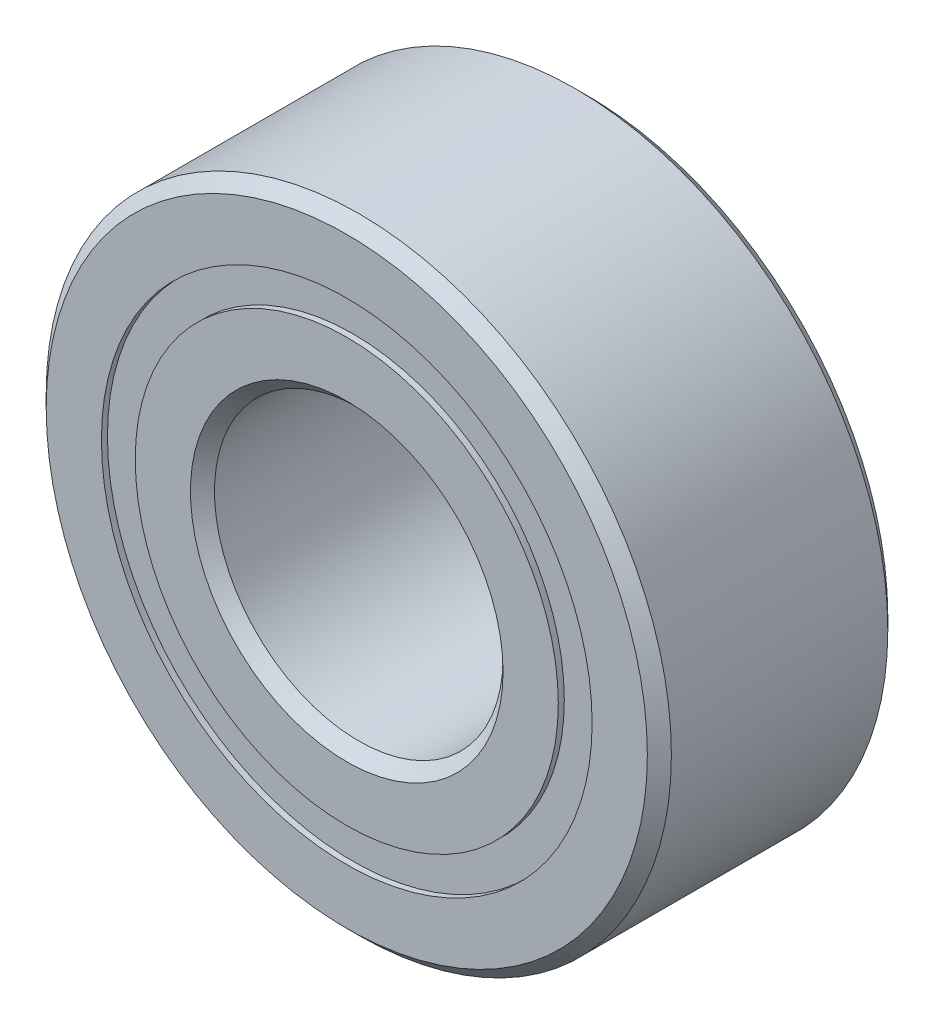
ISO-10303-21;
HEADER;
FILE_DESCRIPTION(('STEP AP214'),'2;1');
FILE_NAME('part.step','',(''),(''),'','','');
FILE_SCHEMA(('AUTOMOTIVE_DESIGN { 1 0 10303 214 1 1 1 1 }'));
ENDSEC;
DATA;
#1=APPLICATION_CONTEXT('core data for automotive mechanical design processes');
#2=APPLICATION_PROTOCOL_DEFINITION('international standard','automotive_design',2000,#1);
#3=PRODUCT_CONTEXT('',#1,'mechanical');
#4=PRODUCT('Part','Part','',(#3));
#5=PRODUCT_RELATED_PRODUCT_CATEGORY('part','',(#4));
#6=PRODUCT_DEFINITION_FORMATION('','',#4);
#7=PRODUCT_DEFINITION_CONTEXT('part definition',#1,'design');
#8=PRODUCT_DEFINITION('design','',#6,#7);
#9=PRODUCT_DEFINITION_SHAPE('','',#8);
#10=(LENGTH_UNIT() NAMED_UNIT(*) SI_UNIT(.MILLI.,.METRE.));
#11=(NAMED_UNIT(*) PLANE_ANGLE_UNIT() SI_UNIT($,.RADIAN.));
#12=(NAMED_UNIT(*) SI_UNIT($,.STERADIAN.) SOLID_ANGLE_UNIT());
#13=UNCERTAINTY_MEASURE_WITH_UNIT(LENGTH_MEASURE(1.E-05),#10,'distance_accuracy_value','');
#14=(GEOMETRIC_REPRESENTATION_CONTEXT(3) GLOBAL_UNCERTAINTY_ASSIGNED_CONTEXT((#13)) GLOBAL_UNIT_ASSIGNED_CONTEXT((#10,
#11,#12)) REPRESENTATION_CONTEXT('',''));
#15=CARTESIAN_POINT('',(0.,0.,0.));
#16=DIRECTION('',(0.,0.,1.));
#17=DIRECTION('',(1.,0.,0.));
#18=AXIS2_PLACEMENT_3D('',#15,#16,#17);
#19=CARTESIAN_POINT('',(0.,5.10164835164835,-2.375));
#20=DIRECTION('',(0.,0.,1.));
#21=DIRECTION('',(1.,0.,0.));
#22=AXIS2_PLACEMENT_3D('',#19,#20,#21);
#23=PLANE('',#22);
#24=CARTESIAN_POINT('',(0.,0.,-2.375));
#25=DIRECTION('',(0.,0.,1.));
#26=DIRECTION('',(1.,0.,0.));
#27=AXIS2_PLACEMENT_3D('',#24,#25,#26);
#28=CIRCLE('',#27,5.10164835164835);
#29=CARTESIAN_POINT('',(5.10164835164835,0.,-2.375));
#30=VERTEX_POINT('',#29);
#31=EDGE_CURVE('E64',#30,#30,#28,.T.);
#32=ORIENTED_EDGE('',*,*,#31,.F.);
#33=EDGE_LOOP('',(#32));
#34=FACE_BOUND('',#33,.T.);
#35=CARTESIAN_POINT('',(0.,0.,-2.375));
#36=DIRECTION('',(0.,0.,1.));
#37=DIRECTION('',(1.,0.,0.));
#38=AXIS2_PLACEMENT_3D('',#35,#36,#37);
#39=CIRCLE('',#38,4.39835164835165);
#40=CARTESIAN_POINT('',(4.39835164835165,0.,-2.375));
#41=VERTEX_POINT('',#40);
#42=EDGE_CURVE('E11',#41,#41,#39,.T.);
#43=ORIENTED_EDGE('',*,*,#42,.T.);
#44=EDGE_LOOP('',(#43));
#45=FACE_BOUND('',#44,.T.);
#46=ADVANCED_FACE('F50',(#34,#45),#23,.F.);
#47=CARTESIAN_POINT('',(0.,0.,2.5));
#48=DIRECTION('',(0.,0.,1.));
#49=DIRECTION('',(1.,0.,0.));
#50=AXIS2_PLACEMENT_3D('',#47,#48,#49);
#51=CYLINDRICAL_SURFACE('',#50,4.39835164835165);
#52=ORIENTED_EDGE('',*,*,#42,.F.);
#53=EDGE_LOOP('',(#52));
#54=FACE_BOUND('',#53,.T.);
#55=CARTESIAN_POINT('',(0.,0.,-1.16542887575844));
#56=DIRECTION('',(0.,0.,1.));
#57=DIRECTION('',(1.,0.,0.));
#58=AXIS2_PLACEMENT_3D('',#55,#56,#57);
#59=CIRCLE('',#58,4.39835164835165);
#60=CARTESIAN_POINT('',(4.39835164835165,0.,-1.16542887575844));
#61=VERTEX_POINT('',#60);
#62=EDGE_CURVE('E56',#61,#61,#59,.T.);
#63=ORIENTED_EDGE('',*,*,#62,.T.);
#64=EDGE_LOOP('',(#63));
#65=FACE_BOUND('',#64,.T.);
#66=ADVANCED_FACE('F73',(#54,#65),#51,.F.);
#67=CARTESIAN_POINT('',(0.,5.10164835164835,-1.16542887575844));
#68=DIRECTION('',(0.,0.,-1.));
#69=DIRECTION('',(-1.,0.,0.));
#70=AXIS2_PLACEMENT_3D('',#67,#68,#69);
#71=PLANE('',#70);
#72=ORIENTED_EDGE('',*,*,#62,.F.);
#73=EDGE_LOOP('',(#72));
#74=FACE_BOUND('',#73,.T.);
#75=CARTESIAN_POINT('',(0.,0.,-1.16542887575844));
#76=DIRECTION('',(0.,0.,1.));
#77=DIRECTION('',(1.,0.,0.));
#78=AXIS2_PLACEMENT_3D('',#75,#76,#77);
#79=CIRCLE('',#78,5.10164835164835);
#80=CARTESIAN_POINT('',(5.10164835164835,0.,-1.16542887575844));
#81=VERTEX_POINT('',#80);
#82=EDGE_CURVE('E60',#81,#81,#79,.T.);
#83=ORIENTED_EDGE('',*,*,#82,.T.);
#84=EDGE_LOOP('',(#83));
#85=FACE_BOUND('',#84,.T.);
#86=ADVANCED_FACE('F77',(#74,#85),#71,.F.);
#87=CARTESIAN_POINT('',(0.,0.,2.5));
#88=DIRECTION('',(0.,0.,1.));
#89=DIRECTION('',(1.,0.,0.));
#90=AXIS2_PLACEMENT_3D('',#87,#88,#89);
#91=CYLINDRICAL_SURFACE('',#90,5.10164835164835);
#92=ORIENTED_EDGE('',*,*,#82,.F.);
#93=EDGE_LOOP('',(#92));
#94=FACE_BOUND('',#93,.T.);
#95=ORIENTED_EDGE('',*,*,#31,.T.);
#96=EDGE_LOOP('',(#95));
#97=FACE_BOUND('',#96,.T.);
#98=ADVANCED_FACE('F70',(#94,#97),#91,.T.);
#99=CLOSED_SHELL('',(#46,#66,#86,#98));
#100=MANIFOLD_SOLID_BREP('B2',#99);
#101=CARTESIAN_POINT('',(0.,5.10164835164835,2.375));
#102=DIRECTION('',(0.,0.,-1.));
#103=DIRECTION('',(-1.,0.,0.));
#104=AXIS2_PLACEMENT_3D('',#101,#102,#103);
#105=PLANE('',#104);
#106=CARTESIAN_POINT('',(0.,0.,2.375));
#107=DIRECTION('',(0.,0.,1.));
#108=DIRECTION('',(1.,0.,0.));
#109=AXIS2_PLACEMENT_3D('',#106,#107,#108);
#110=CIRCLE('',#109,4.39835164835165);
#111=CARTESIAN_POINT('',(4.39835164835165,0.,2.375));
#112=VERTEX_POINT('',#111);
#113=EDGE_CURVE('E49',#112,#112,#110,.T.);
#114=ORIENTED_EDGE('',*,*,#113,.F.);
#115=EDGE_LOOP('',(#114));
#116=FACE_BOUND('',#115,.T.);
#117=CARTESIAN_POINT('',(0.,0.,2.375));
#118=DIRECTION('',(0.,0.,1.));
#119=DIRECTION('',(1.,0.,0.));
#120=AXIS2_PLACEMENT_3D('',#117,#118,#119);
#121=CIRCLE('',#120,5.10164835164835);
#122=CARTESIAN_POINT('',(5.10164835164835,0.,2.375));
#123=VERTEX_POINT('',#122);
#124=EDGE_CURVE('E124',#123,#123,#121,.T.);
#125=ORIENTED_EDGE('',*,*,#124,.T.);
#126=EDGE_LOOP('',(#125));
#127=FACE_BOUND('',#126,.T.);
#128=ADVANCED_FACE('F110',(#116,#127),#105,.F.);
#129=CARTESIAN_POINT('',(0.,0.,2.5));
#130=DIRECTION('',(0.,0.,1.));
#131=DIRECTION('',(1.,0.,0.));
#132=AXIS2_PLACEMENT_3D('',#129,#130,#131);
#133=CYLINDRICAL_SURFACE('',#132,4.39835164835165);
#134=CARTESIAN_POINT('',(0.,0.,1.16542887575844));
#135=DIRECTION('',(0.,0.,1.));
#136=DIRECTION('',(1.,0.,0.));
#137=AXIS2_PLACEMENT_3D('',#134,#135,#136);
#138=CIRCLE('',#137,4.39835164835165);
#139=CARTESIAN_POINT('',(4.39835164835165,0.,1.16542887575844));
#140=VERTEX_POINT('',#139);
#141=EDGE_CURVE('E116',#140,#140,#138,.T.);
#142=ORIENTED_EDGE('',*,*,#141,.F.);
#143=EDGE_LOOP('',(#142));
#144=FACE_BOUND('',#143,.T.);
#145=ORIENTED_EDGE('',*,*,#113,.T.);
#146=EDGE_LOOP('',(#145));
#147=FACE_BOUND('',#146,.T.);
#148=ADVANCED_FACE('F139',(#144,#147),#133,.F.);
#149=CARTESIAN_POINT('',(0.,5.10164835164835,1.16542887575844));
#150=DIRECTION('',(0.,0.,1.));
#151=DIRECTION('',(1.,0.,0.));
#152=AXIS2_PLACEMENT_3D('',#149,#150,#151);
#153=PLANE('',#152);
#154=CARTESIAN_POINT('',(0.,0.,1.16542887575844));
#155=DIRECTION('',(0.,0.,1.));
#156=DIRECTION('',(1.,0.,0.));
#157=AXIS2_PLACEMENT_3D('',#154,#155,#156);
#158=CIRCLE('',#157,5.10164835164835);
#159=CARTESIAN_POINT('',(5.10164835164835,0.,1.16542887575844));
#160=VERTEX_POINT('',#159);
#161=EDGE_CURVE('E120',#160,#160,#158,.T.);
#162=ORIENTED_EDGE('',*,*,#161,.F.);
#163=EDGE_LOOP('',(#162));
#164=FACE_BOUND('',#163,.T.);
#165=ORIENTED_EDGE('',*,*,#141,.T.);
#166=EDGE_LOOP('',(#165));
#167=FACE_BOUND('',#166,.T.);
#168=ADVANCED_FACE('F134',(#164,#167),#153,.F.);
#169=CARTESIAN_POINT('',(0.,0.,2.5));
#170=DIRECTION('',(0.,0.,1.));
#171=DIRECTION('',(1.,0.,0.));
#172=AXIS2_PLACEMENT_3D('',#169,#170,#171);
#173=CYLINDRICAL_SURFACE('',#172,5.10164835164835);
#174=ORIENTED_EDGE('',*,*,#124,.F.);
#175=EDGE_LOOP('',(#174));
#176=FACE_BOUND('',#175,.T.);
#177=ORIENTED_EDGE('',*,*,#161,.T.);
#178=EDGE_LOOP('',(#177));
#179=FACE_BOUND('',#178,.T.);
#180=ADVANCED_FACE('F131',(#176,#179),#173,.T.);
#181=CLOSED_SHELL('',(#128,#148,#168,#180));
#182=MANIFOLD_SOLID_BREP('B6',#181);
#183=CARTESIAN_POINT('',(-2.37499999999995,4.11362066797611,0.));
#184=DIRECTION('',(0.,0.,1.));
#185=DIRECTION('',(-0.499999999999989,0.866025403784445,0.));
#186=AXIS2_PLACEMENT_3D('',#183,#184,#185);
#187=SPHERICAL_SURFACE('',#186,1.16542887575844);
#188=CARTESIAN_POINT('',(-2.37499999999995,4.11362066797611,1.16542887575844));
#189=VERTEX_POINT('',#188);
#190=VERTEX_LOOP('',#189);
#191=FACE_BOUND('',#190,.T.);
#192=ADVANCED_FACE('F170',(#191),#187,.T.);
#193=CLOSED_SHELL('',(#192));
#194=MANIFOLD_SOLID_BREP('B44',#193);
#195=CARTESIAN_POINT('',(-4.11362066797606,2.37500000000005,0.));
#196=DIRECTION('',(0.,0.,1.));
#197=DIRECTION('',(-0.866025403784433,0.50000000000001,0.));
#198=AXIS2_PLACEMENT_3D('',#195,#196,#197);
#199=SPHERICAL_SURFACE('',#198,1.16542887575844);
#200=CARTESIAN_POINT('',(-4.11362066797606,2.37500000000005,1.16542887575844));
#201=VERTEX_POINT('',#200);
#202=VERTEX_LOOP('',#201);
#203=FACE_BOUND('',#202,.T.);
#204=ADVANCED_FACE('F193',(#203),#199,.T.);
#205=CLOSED_SHELL('',(#204));
#206=MANIFOLD_SOLID_BREP('B106',#205);
#207=CARTESIAN_POINT('',(-4.75,0.,0.));
#208=DIRECTION('',(0.,0.,1.));
#209=DIRECTION('',(-1.,0.,0.));
#210=AXIS2_PLACEMENT_3D('',#207,#208,#209);
#211=SPHERICAL_SURFACE('',#210,1.16542887575844);
#212=CARTESIAN_POINT('',(-4.75,0.,1.16542887575844));
#213=VERTEX_POINT('',#212);
#214=VERTEX_LOOP('',#213);
#215=FACE_BOUND('',#214,.T.);
#216=ADVANCED_FACE('F216',(#215),#211,.T.);
#217=CLOSED_SHELL('',(#216));
#218=MANIFOLD_SOLID_BREP('B166',#217);
#219=CARTESIAN_POINT('',(-4.1136206679761,-2.37499999999996,0.));
#220=DIRECTION('',(0.,0.,1.));
#221=DIRECTION('',(-0.866025403784443,-0.499999999999992,0.));
#222=AXIS2_PLACEMENT_3D('',#219,#220,#221);
#223=SPHERICAL_SURFACE('',#222,1.16542887575844);
#224=CARTESIAN_POINT('',(-4.1136206679761,-2.37499999999996,1.16542887575844));
#225=VERTEX_POINT('',#224);
#226=VERTEX_LOOP('',#225);
#227=FACE_BOUND('',#226,.T.);
#228=ADVANCED_FACE('F239',(#227),#223,.T.);
#229=CLOSED_SHELL('',(#228));
#230=MANIFOLD_SOLID_BREP('B189',#229);
#231=CARTESIAN_POINT('',(-2.37500000000003,-4.11362066797606,0.));
#232=DIRECTION('',(0.,0.,1.));
#233=DIRECTION('',(-0.500000000000007,-0.866025403784435,0.));
#234=AXIS2_PLACEMENT_3D('',#231,#232,#233);
#235=SPHERICAL_SURFACE('',#234,1.16542887575844);
#236=CARTESIAN_POINT('',(-2.37500000000003,-4.11362066797606,1.16542887575844));
#237=VERTEX_POINT('',#236);
#238=VERTEX_LOOP('',#237);
#239=FACE_BOUND('',#238,.T.);
#240=ADVANCED_FACE('F262',(#239),#235,.T.);
#241=CLOSED_SHELL('',(#240));
#242=MANIFOLD_SOLID_BREP('B212',#241);
#243=CARTESIAN_POINT('',(0.,-4.75,0.));
#244=DIRECTION('',(0.,0.,1.));
#245=DIRECTION('',(0.,-1.,0.));
#246=AXIS2_PLACEMENT_3D('',#243,#244,#245);
#247=SPHERICAL_SURFACE('',#246,1.16542887575844);
#248=CARTESIAN_POINT('',(0.,-4.75,1.16542887575844));
#249=VERTEX_POINT('',#248);
#250=VERTEX_LOOP('',#249);
#251=FACE_BOUND('',#250,.T.);
#252=ADVANCED_FACE('F285',(#251),#247,.T.);
#253=CLOSED_SHELL('',(#252));
#254=MANIFOLD_SOLID_BREP('B235',#253);
#255=CARTESIAN_POINT('',(2.37499999999998,-4.1136206679761,0.));
#256=DIRECTION('',(0.,0.,1.));
#257=DIRECTION('',(0.499999999999995,-0.866025403784442,0.));
#258=AXIS2_PLACEMENT_3D('',#255,#256,#257);
#259=SPHERICAL_SURFACE('',#258,1.16542887575844);
#260=CARTESIAN_POINT('',(2.37499999999998,-4.1136206679761,1.16542887575844));
#261=VERTEX_POINT('',#260);
#262=VERTEX_LOOP('',#261);
#263=FACE_BOUND('',#262,.T.);
#264=ADVANCED_FACE('F308',(#263),#259,.T.);
#265=CLOSED_SHELL('',(#264));
#266=MANIFOLD_SOLID_BREP('B258',#265);
#267=CARTESIAN_POINT('',(4.11362066797607,-2.37500000000002,0.));
#268=DIRECTION('',(0.,0.,1.));
#269=DIRECTION('',(0.866025403784436,-0.500000000000004,0.));
#270=AXIS2_PLACEMENT_3D('',#267,#268,#269);
#271=SPHERICAL_SURFACE('',#270,1.16542887575844);
#272=CARTESIAN_POINT('',(4.11362066797607,-2.37500000000002,1.16542887575844));
#273=VERTEX_POINT('',#272);
#274=VERTEX_LOOP('',#273);
#275=FACE_BOUND('',#274,.T.);
#276=ADVANCED_FACE('F331',(#275),#271,.T.);
#277=CLOSED_SHELL('',(#276));
#278=MANIFOLD_SOLID_BREP('B281',#277);
#279=CARTESIAN_POINT('',(4.75,0.,0.));
#280=DIRECTION('',(0.,0.,1.));
#281=DIRECTION('',(1.,0.,0.));
#282=AXIS2_PLACEMENT_3D('',#279,#280,#281);
#283=SPHERICAL_SURFACE('',#282,1.16542887575844);
#284=CARTESIAN_POINT('',(4.75,0.,1.16542887575844));
#285=VERTEX_POINT('',#284);
#286=VERTEX_LOOP('',#285);
#287=FACE_BOUND('',#286,.T.);
#288=ADVANCED_FACE('F354',(#287),#283,.T.);
#289=CLOSED_SHELL('',(#288));
#290=MANIFOLD_SOLID_BREP('B304',#289);
#291=CARTESIAN_POINT('',(4.11362066797609,2.37499999999999,0.));
#292=DIRECTION('',(0.,0.,1.));
#293=DIRECTION('',(0.86602540378444,0.499999999999998,0.));
#294=AXIS2_PLACEMENT_3D('',#291,#292,#293);
#295=SPHERICAL_SURFACE('',#294,1.16542887575844);
#296=CARTESIAN_POINT('',(4.11362066797609,2.37499999999999,1.16542887575844));
#297=VERTEX_POINT('',#296);
#298=VERTEX_LOOP('',#297);
#299=FACE_BOUND('',#298,.T.);
#300=ADVANCED_FACE('F377',(#299),#295,.T.);
#301=CLOSED_SHELL('',(#300));
#302=MANIFOLD_SOLID_BREP('B327',#301);
#303=CARTESIAN_POINT('',(2.375,4.11362066797608,0.));
#304=DIRECTION('',(0.,0.,1.));
#305=DIRECTION('',(0.500000000000001,0.866025403784438,0.));
#306=AXIS2_PLACEMENT_3D('',#303,#304,#305);
#307=SPHERICAL_SURFACE('',#306,1.16542887575844);
#308=CARTESIAN_POINT('',(2.375,4.11362066797608,1.16542887575844));
#309=VERTEX_POINT('',#308);
#310=VERTEX_LOOP('',#309);
#311=FACE_BOUND('',#310,.T.);
#312=ADVANCED_FACE('F400',(#311),#307,.T.);
#313=CLOSED_SHELL('',(#312));
#314=MANIFOLD_SOLID_BREP('B350',#313);
#315=CARTESIAN_POINT('',(0.,4.75,0.));
#316=DIRECTION('',(0.,0.,1.));
#317=DIRECTION('',(0.,1.,0.));
#318=AXIS2_PLACEMENT_3D('',#315,#316,#317);
#319=SPHERICAL_SURFACE('',#318,1.16542887575844);
#320=CARTESIAN_POINT('',(0.,4.75,1.16542887575844));
#321=VERTEX_POINT('',#320);
#322=VERTEX_LOOP('',#321);
#323=FACE_BOUND('',#322,.T.);
#324=ADVANCED_FACE('F425',(#323),#319,.T.);
#325=CLOSED_SHELL('',(#324));
#326=MANIFOLD_SOLID_BREP('B373',#325);
#327=CARTESIAN_POINT('',(0.,4.39835164835165,2.5));
#328=DIRECTION('',(0.,0.,-1.));
#329=DIRECTION('',(-1.,0.,0.));
#330=AXIS2_PLACEMENT_3D('',#327,#328,#329);
#331=PLANE('',#330);
#332=CARTESIAN_POINT('',(0.,0.,2.5));
#333=DIRECTION('',(0.,0.,1.));
#334=DIRECTION('',(1.,0.,0.));
#335=AXIS2_PLACEMENT_3D('',#332,#333,#334);
#336=CIRCLE('',#335,3.25);
#337=CARTESIAN_POINT('',(3.25,0.,2.5));
#338=VERTEX_POINT('',#337);
#339=EDGE_CURVE('E471',#338,#338,#336,.T.);
#340=ORIENTED_EDGE('',*,*,#339,.F.);
#341=EDGE_LOOP('',(#340));
#342=FACE_BOUND('',#341,.T.);
#343=CARTESIAN_POINT('',(0.,0.,2.5));
#344=DIRECTION('',(0.,0.,1.));
#345=DIRECTION('',(1.,0.,0.));
#346=AXIS2_PLACEMENT_3D('',#343,#344,#345);
#347=CIRCLE('',#346,4.39835164835165);
#348=CARTESIAN_POINT('',(4.39835164835165,0.,2.5));
#349=VERTEX_POINT('',#348);
#350=EDGE_CURVE('E424',#349,#349,#347,.T.);
#351=ORIENTED_EDGE('',*,*,#350,.T.);
#352=EDGE_LOOP('',(#351));
#353=FACE_BOUND('',#352,.T.);
#354=ADVANCED_FACE('F443',(#342,#353),#331,.F.);
#355=CARTESIAN_POINT('',(0.,0.,2.5));
#356=DIRECTION('',(0.,0.,1.));
#357=DIRECTION('',(1.,0.,0.));
#358=AXIS2_PLACEMENT_3D('',#355,#356,#357);
#359=CYLINDRICAL_SURFACE('',#358,4.39835164835165);
#360=ORIENTED_EDGE('',*,*,#350,.F.);
#361=EDGE_LOOP('',(#360));
#362=FACE_BOUND('',#361,.T.);
#363=CARTESIAN_POINT('',(0.,0.,1.11111111111111));
#364=DIRECTION('',(0.,0.,1.));
#365=DIRECTION('',(1.,0.,0.));
#366=AXIS2_PLACEMENT_3D('',#363,#364,#365);
#367=CIRCLE('',#366,4.39835164835165);
#368=CARTESIAN_POINT('',(4.39835164835165,0.,1.11111111111111));
#369=VERTEX_POINT('',#368);
#370=EDGE_CURVE('E449',#369,#369,#367,.T.);
#371=ORIENTED_EDGE('',*,*,#370,.T.);
#372=EDGE_LOOP('',(#371));
#373=FACE_BOUND('',#372,.T.);
#374=ADVANCED_FACE('F478',(#362,#373),#359,.T.);
#375=CARTESIAN_POINT('',(0.,0.,0.));
#376=DIRECTION('',(0.,0.,1.));
#377=DIRECTION('',(1.,0.,0.));
#378=AXIS2_PLACEMENT_3D('',#375,#376,#377);
#379=TOROIDAL_SURFACE('',#378,4.75,1.16542887575843);
#380=ORIENTED_EDGE('',*,*,#370,.F.);
#381=EDGE_LOOP('',(#380));
#382=FACE_BOUND('',#381,.T.);
#383=CARTESIAN_POINT('',(0.,0.,-1.11111111111111));
#384=DIRECTION('',(0.,0.,1.));
#385=DIRECTION('',(1.,0.,0.));
#386=AXIS2_PLACEMENT_3D('',#383,#384,#385);
#387=CIRCLE('',#386,4.39835164835165);
#388=CARTESIAN_POINT('',(4.39835164835165,0.,-1.11111111111111));
#389=VERTEX_POINT('',#388);
#390=EDGE_CURVE('E453',#389,#389,#387,.T.);
#391=ORIENTED_EDGE('',*,*,#390,.T.);
#392=EDGE_LOOP('',(#391));
#393=FACE_BOUND('',#392,.T.);
#394=ADVANCED_FACE('F482',(#382,#393),#379,.F.);
#395=CARTESIAN_POINT('',(0.,0.,2.5));
#396=DIRECTION('',(0.,0.,1.));
#397=DIRECTION('',(1.,0.,0.));
#398=AXIS2_PLACEMENT_3D('',#395,#396,#397);
#399=CYLINDRICAL_SURFACE('',#398,4.39835164835165);
#400=ORIENTED_EDGE('',*,*,#390,.F.);
#401=EDGE_LOOP('',(#400));
#402=FACE_BOUND('',#401,.T.);
#403=CARTESIAN_POINT('',(0.,0.,-2.5));
#404=DIRECTION('',(0.,0.,1.));
#405=DIRECTION('',(1.,0.,0.));
#406=AXIS2_PLACEMENT_3D('',#403,#404,#405);
#407=CIRCLE('',#406,4.39835164835165);
#408=CARTESIAN_POINT('',(4.39835164835165,0.,-2.5));
#409=VERTEX_POINT('',#408);
#410=EDGE_CURVE('E457',#409,#409,#407,.T.);
#411=ORIENTED_EDGE('',*,*,#410,.T.);
#412=EDGE_LOOP('',(#411));
#413=FACE_BOUND('',#412,.T.);
#414=ADVANCED_FACE('F487',(#402,#413),#399,.T.);
#415=CARTESIAN_POINT('',(0.,3.25,-2.5));
#416=DIRECTION('',(0.,0.,1.));
#417=DIRECTION('',(1.,0.,0.));
#418=AXIS2_PLACEMENT_3D('',#415,#416,#417);
#419=PLANE('',#418);
#420=ORIENTED_EDGE('',*,*,#410,.F.);
#421=EDGE_LOOP('',(#420));
#422=FACE_BOUND('',#421,.T.);
#423=CARTESIAN_POINT('',(0.,0.,-2.5));
#424=DIRECTION('',(0.,0.,1.));
#425=DIRECTION('',(1.,0.,0.));
#426=AXIS2_PLACEMENT_3D('',#423,#424,#425);
#427=CIRCLE('',#426,3.25);
#428=CARTESIAN_POINT('',(3.25,0.,-2.5));
#429=VERTEX_POINT('',#428);
#430=EDGE_CURVE('E462',#429,#429,#427,.T.);
#431=ORIENTED_EDGE('',*,*,#430,.T.);
#432=EDGE_LOOP('',(#431));
#433=FACE_BOUND('',#432,.T.);
#434=ADVANCED_FACE('F493',(#422,#433),#419,.F.);
#435=CARTESIAN_POINT('',(0.,0.,-2.25));
#436=DIRECTION('',(0.,0.,-1.));
#437=DIRECTION('',(-1.,0.,0.));
#438=AXIS2_PLACEMENT_3D('',#435,#436,#437);
#439=CONICAL_SURFACE('',#438,3.,0.785398163397447);
#440=ORIENTED_EDGE('',*,*,#430,.F.);
#441=EDGE_LOOP('',(#440));
#442=FACE_BOUND('',#441,.T.);
#443=CARTESIAN_POINT('',(0.,0.,-2.25));
#444=DIRECTION('',(0.,0.,1.));
#445=DIRECTION('',(1.,0.,0.));
#446=AXIS2_PLACEMENT_3D('',#443,#444,#445);
#447=CIRCLE('',#446,3.);
#448=CARTESIAN_POINT('',(3.,0.,-2.25));
#449=VERTEX_POINT('',#448);
#450=EDGE_CURVE('E465',#449,#449,#447,.T.);
#451=ORIENTED_EDGE('',*,*,#450,.T.);
#452=EDGE_LOOP('',(#451));
#453=FACE_BOUND('',#452,.T.);
#454=ADVANCED_FACE('F497',(#442,#453),#439,.F.);
#455=CARTESIAN_POINT('',(0.,0.,2.5));
#456=DIRECTION('',(0.,0.,1.));
#457=DIRECTION('',(1.,0.,0.));
#458=AXIS2_PLACEMENT_3D('',#455,#456,#457);
#459=CYLINDRICAL_SURFACE('',#458,3.);
#460=ORIENTED_EDGE('',*,*,#450,.F.);
#461=EDGE_LOOP('',(#460));
#462=FACE_BOUND('',#461,.T.);
#463=CARTESIAN_POINT('',(0.,0.,2.25));
#464=DIRECTION('',(0.,0.,1.));
#465=DIRECTION('',(1.,0.,0.));
#466=AXIS2_PLACEMENT_3D('',#463,#464,#465);
#467=CIRCLE('',#466,3.);
#468=CARTESIAN_POINT('',(3.,0.,2.25));
#469=VERTEX_POINT('',#468);
#470=EDGE_CURVE('E468',#469,#469,#467,.T.);
#471=ORIENTED_EDGE('',*,*,#470,.T.);
#472=EDGE_LOOP('',(#471));
#473=FACE_BOUND('',#472,.T.);
#474=ADVANCED_FACE('F501',(#462,#473),#459,.F.);
#475=CARTESIAN_POINT('',(0.,0.,2.5));
#476=DIRECTION('',(0.,0.,1.));
#477=DIRECTION('',(1.,0.,0.));
#478=AXIS2_PLACEMENT_3D('',#475,#476,#477);
#479=CONICAL_SURFACE('',#478,3.25,0.785398163397452);
#480=ORIENTED_EDGE('',*,*,#470,.F.);
#481=EDGE_LOOP('',(#480));
#482=FACE_BOUND('',#481,.T.);
#483=ORIENTED_EDGE('',*,*,#339,.T.);
#484=EDGE_LOOP('',(#483));
#485=FACE_BOUND('',#484,.T.);
#486=ADVANCED_FACE('F475',(#482,#485),#479,.F.);
#487=CLOSED_SHELL('',(#354,#374,#394,#414,#434,#454,#474,#486));
#488=MANIFOLD_SOLID_BREP('B396',#487);
#489=CARTESIAN_POINT('',(0.,0.,2.25));
#490=DIRECTION('',(0.,0.,-1.));
#491=DIRECTION('',(-1.,0.,0.));
#492=AXIS2_PLACEMENT_3D('',#489,#490,#491);
#493=CONICAL_SURFACE('',#492,6.5,0.785398163397445);
#494=CARTESIAN_POINT('',(0.,0.,2.5));
#495=DIRECTION('',(0.,0.,1.));
#496=DIRECTION('',(1.,0.,0.));
#497=AXIS2_PLACEMENT_3D('',#494,#495,#496);
#498=CIRCLE('',#497,6.25);
#499=CARTESIAN_POINT('',(6.25,0.,2.5));
#500=VERTEX_POINT('',#499);
#501=EDGE_CURVE('E577',#500,#500,#498,.T.);
#502=ORIENTED_EDGE('',*,*,#501,.F.);
#503=EDGE_LOOP('',(#502));
#504=FACE_BOUND('',#503,.T.);
#505=CARTESIAN_POINT('',(0.,0.,2.25));
#506=DIRECTION('',(0.,0.,1.));
#507=DIRECTION('',(1.,0.,0.));
#508=AXIS2_PLACEMENT_3D('',#505,#506,#507);
#509=CIRCLE('',#508,6.5);
#510=CARTESIAN_POINT('',(6.5,0.,2.25));
#511=VERTEX_POINT('',#510);
#512=EDGE_CURVE('E442',#511,#511,#509,.T.);
#513=ORIENTED_EDGE('',*,*,#512,.T.);
#514=EDGE_LOOP('',(#513));
#515=FACE_BOUND('',#514,.T.);
#516=ADVANCED_FACE('F549',(#504,#515),#493,.T.);
#517=CARTESIAN_POINT('',(0.,0.,2.5));
#518=DIRECTION('',(0.,0.,1.));
#519=DIRECTION('',(1.,0.,0.));
#520=AXIS2_PLACEMENT_3D('',#517,#518,#519);
#521=CYLINDRICAL_SURFACE('',#520,6.5);
#522=ORIENTED_EDGE('',*,*,#512,.F.);
#523=EDGE_LOOP('',(#522));
#524=FACE_BOUND('',#523,.T.);
#525=CARTESIAN_POINT('',(0.,0.,-2.25));
#526=DIRECTION('',(0.,0.,1.));
#527=DIRECTION('',(1.,0.,0.));
#528=AXIS2_PLACEMENT_3D('',#525,#526,#527);
#529=CIRCLE('',#528,6.5);
#530=CARTESIAN_POINT('',(6.5,0.,-2.25));
#531=VERTEX_POINT('',#530);
#532=EDGE_CURVE('E555',#531,#531,#529,.T.);
#533=ORIENTED_EDGE('',*,*,#532,.T.);
#534=EDGE_LOOP('',(#533));
#535=FACE_BOUND('',#534,.T.);
#536=ADVANCED_FACE('F584',(#524,#535),#521,.T.);
#537=CARTESIAN_POINT('',(0.,0.,-2.5));
#538=DIRECTION('',(0.,0.,1.));
#539=DIRECTION('',(1.,0.,0.));
#540=AXIS2_PLACEMENT_3D('',#537,#538,#539);
#541=CONICAL_SURFACE('',#540,6.25,0.785398163397445);
#542=ORIENTED_EDGE('',*,*,#532,.F.);
#543=EDGE_LOOP('',(#542));
#544=FACE_BOUND('',#543,.T.);
#545=CARTESIAN_POINT('',(0.,0.,-2.5));
#546=DIRECTION('',(0.,0.,1.));
#547=DIRECTION('',(1.,0.,0.));
#548=AXIS2_PLACEMENT_3D('',#545,#546,#547);
#549=CIRCLE('',#548,6.25);
#550=CARTESIAN_POINT('',(6.25,0.,-2.5));
#551=VERTEX_POINT('',#550);
#552=EDGE_CURVE('E559',#551,#551,#549,.T.);
#553=ORIENTED_EDGE('',*,*,#552,.T.);
#554=EDGE_LOOP('',(#553));
#555=FACE_BOUND('',#554,.T.);
#556=ADVANCED_FACE('F588',(#544,#555),#541,.T.);
#557=CARTESIAN_POINT('',(0.,6.25,-2.5));
#558=DIRECTION('',(0.,0.,1.));
#559=DIRECTION('',(1.,0.,0.));
#560=AXIS2_PLACEMENT_3D('',#557,#558,#559);
#561=PLANE('',#560);
#562=ORIENTED_EDGE('',*,*,#552,.F.);
#563=EDGE_LOOP('',(#562));
#564=FACE_BOUND('',#563,.T.);
#565=CARTESIAN_POINT('',(0.,0.,-2.5));
#566=DIRECTION('',(0.,0.,1.));
#567=DIRECTION('',(1.,0.,0.));
#568=AXIS2_PLACEMENT_3D('',#565,#566,#567);
#569=CIRCLE('',#568,5.10164835164835);
#570=CARTESIAN_POINT('',(5.10164835164835,0.,-2.5));
#571=VERTEX_POINT('',#570);
#572=EDGE_CURVE('E563',#571,#571,#569,.T.);
#573=ORIENTED_EDGE('',*,*,#572,.T.);
#574=EDGE_LOOP('',(#573));
#575=FACE_BOUND('',#574,.T.);
#576=ADVANCED_FACE('F593',(#564,#575),#561,.F.);
#577=CARTESIAN_POINT('',(0.,0.,2.5));
#578=DIRECTION('',(0.,0.,1.));
#579=DIRECTION('',(1.,0.,0.));
#580=AXIS2_PLACEMENT_3D('',#577,#578,#579);
#581=CYLINDRICAL_SURFACE('',#580,5.10164835164835);
#582=ORIENTED_EDGE('',*,*,#572,.F.);
#583=EDGE_LOOP('',(#582));
#584=FACE_BOUND('',#583,.T.);
#585=CARTESIAN_POINT('',(0.,0.,-1.11111111111111));
#586=DIRECTION('',(0.,0.,1.));
#587=DIRECTION('',(1.,0.,0.));
#588=AXIS2_PLACEMENT_3D('',#585,#586,#587);
#589=CIRCLE('',#588,5.10164835164835);
#590=CARTESIAN_POINT('',(5.10164835164835,0.,-1.11111111111111));
#591=VERTEX_POINT('',#590);
#592=EDGE_CURVE('E568',#591,#591,#589,.T.);
#593=ORIENTED_EDGE('',*,*,#592,.T.);
#594=EDGE_LOOP('',(#593));
#595=FACE_BOUND('',#594,.T.);
#596=ADVANCED_FACE('F599',(#584,#595),#581,.F.);
#597=CARTESIAN_POINT('',(0.,0.,0.));
#598=DIRECTION('',(0.,0.,1.));
#599=DIRECTION('',(1.,0.,0.));
#600=AXIS2_PLACEMENT_3D('',#597,#598,#599);
#601=TOROIDAL_SURFACE('',#600,4.75,1.16542887575844);
#602=ORIENTED_EDGE('',*,*,#592,.F.);
#603=EDGE_LOOP('',(#602));
#604=FACE_BOUND('',#603,.T.);
#605=CARTESIAN_POINT('',(0.,0.,1.11111111111111));
#606=DIRECTION('',(0.,0.,1.));
#607=DIRECTION('',(1.,0.,0.));
#608=AXIS2_PLACEMENT_3D('',#605,#606,#607);
#609=CIRCLE('',#608,5.10164835164835);
#610=CARTESIAN_POINT('',(5.10164835164835,0.,1.11111111111111));
#611=VERTEX_POINT('',#610);
#612=EDGE_CURVE('E571',#611,#611,#609,.T.);
#613=ORIENTED_EDGE('',*,*,#612,.T.);
#614=EDGE_LOOP('',(#613));
#615=FACE_BOUND('',#614,.T.);
#616=ADVANCED_FACE('F603',(#604,#615),#601,.F.);
#617=CARTESIAN_POINT('',(0.,0.,2.5));
#618=DIRECTION('',(0.,0.,1.));
#619=DIRECTION('',(1.,0.,0.));
#620=AXIS2_PLACEMENT_3D('',#617,#618,#619);
#621=CYLINDRICAL_SURFACE('',#620,5.10164835164835);
#622=ORIENTED_EDGE('',*,*,#612,.F.);
#623=EDGE_LOOP('',(#622));
#624=FACE_BOUND('',#623,.T.);
#625=CARTESIAN_POINT('',(0.,0.,2.5));
#626=DIRECTION('',(0.,0.,1.));
#627=DIRECTION('',(1.,0.,0.));
#628=AXIS2_PLACEMENT_3D('',#625,#626,#627);
#629=CIRCLE('',#628,5.10164835164835);
#630=CARTESIAN_POINT('',(5.10164835164835,0.,2.5));
#631=VERTEX_POINT('',#630);
#632=EDGE_CURVE('E574',#631,#631,#629,.T.);
#633=ORIENTED_EDGE('',*,*,#632,.T.);
#634=EDGE_LOOP('',(#633));
#635=FACE_BOUND('',#634,.T.);
#636=ADVANCED_FACE('F607',(#624,#635),#621,.F.);
#637=CARTESIAN_POINT('',(0.,6.25,2.5));
#638=DIRECTION('',(0.,0.,-1.));
#639=DIRECTION('',(-1.,0.,0.));
#640=AXIS2_PLACEMENT_3D('',#637,#638,#639);
#641=PLANE('',#640);
#642=ORIENTED_EDGE('',*,*,#632,.F.);
#643=EDGE_LOOP('',(#642));
#644=FACE_BOUND('',#643,.T.);
#645=ORIENTED_EDGE('',*,*,#501,.T.);
#646=EDGE_LOOP('',(#645));
#647=FACE_BOUND('',#646,.T.);
#648=ADVANCED_FACE('F581',(#644,#647),#641,.F.);
#649=CLOSED_SHELL('',(#516,#536,#556,#576,#596,#616,#636,#648));
#650=MANIFOLD_SOLID_BREP('B419',#649);
#651=ADVANCED_BREP_SHAPE_REPRESENTATION('',(#18,#100,#182,#194,#206,#218,#230,#242,#254,#266,
#278,#290,#302,#314,#326,#488,#650),#14);
#652=SHAPE_DEFINITION_REPRESENTATION(#9,#651);
ENDSEC;
END-ISO-10303-21;
